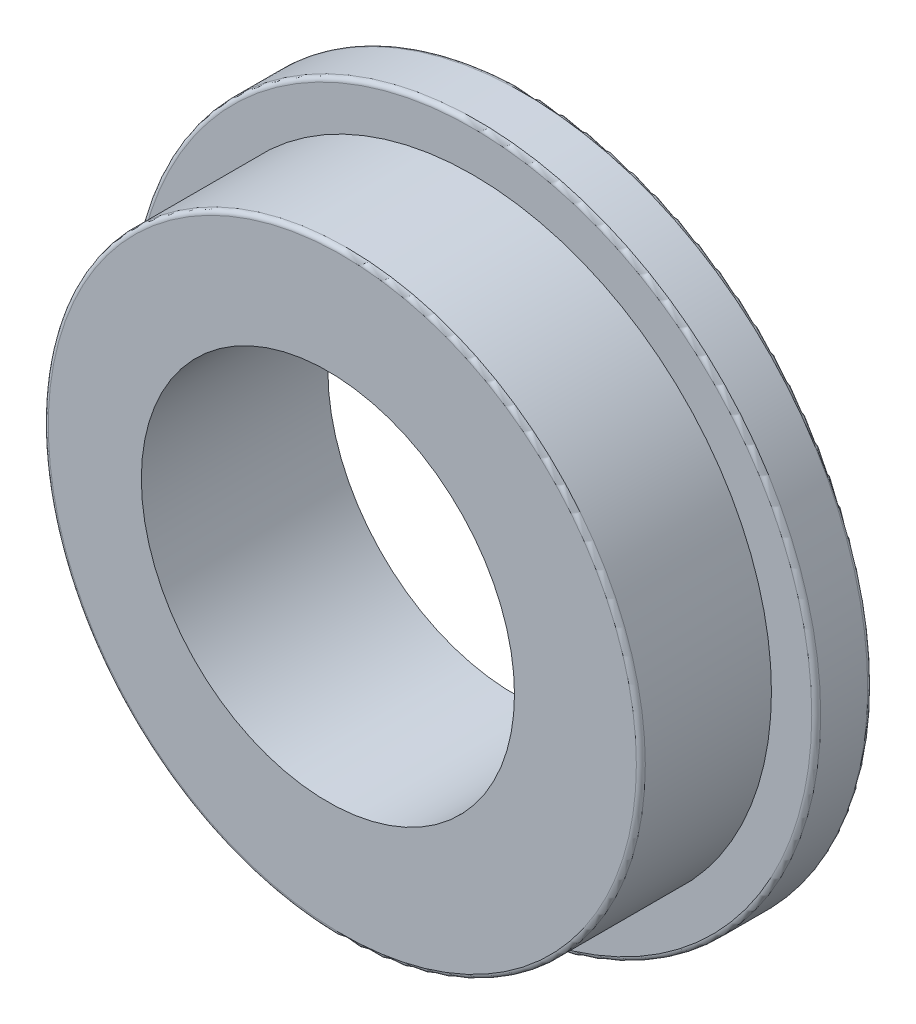
ISO-10303-21;
HEADER;
FILE_DESCRIPTION(('STEP AP214'),'2;1');
FILE_NAME('part.step','',(''),(''),'','','');
FILE_SCHEMA(('AUTOMOTIVE_DESIGN { 1 0 10303 214 1 1 1 1 }'));
ENDSEC;
DATA;
#1=APPLICATION_CONTEXT('core data for automotive mechanical design processes');
#2=APPLICATION_PROTOCOL_DEFINITION('international standard','automotive_design',2000,#1);
#3=PRODUCT_CONTEXT('',#1,'mechanical');
#4=PRODUCT('Part','Part','',(#3));
#5=PRODUCT_RELATED_PRODUCT_CATEGORY('part','',(#4));
#6=PRODUCT_DEFINITION_FORMATION('','',#4);
#7=PRODUCT_DEFINITION_CONTEXT('part definition',#1,'design');
#8=PRODUCT_DEFINITION('design','',#6,#7);
#9=PRODUCT_DEFINITION_SHAPE('','',#8);
#10=(LENGTH_UNIT() NAMED_UNIT(*) SI_UNIT(.MILLI.,.METRE.));
#11=(NAMED_UNIT(*) PLANE_ANGLE_UNIT() SI_UNIT($,.RADIAN.));
#12=(NAMED_UNIT(*) SI_UNIT($,.STERADIAN.) SOLID_ANGLE_UNIT());
#13=UNCERTAINTY_MEASURE_WITH_UNIT(LENGTH_MEASURE(1.E-05),#10,'distance_accuracy_value','');
#14=(GEOMETRIC_REPRESENTATION_CONTEXT(3) GLOBAL_UNCERTAINTY_ASSIGNED_CONTEXT((#13)) GLOBAL_UNIT_ASSIGNED_CONTEXT((#10,
#11,#12)) REPRESENTATION_CONTEXT('',''));
#15=CARTESIAN_POINT('',(0.,0.,0.));
#16=DIRECTION('',(0.,0.,1.));
#17=DIRECTION('',(1.,0.,0.));
#18=AXIS2_PLACEMENT_3D('',#15,#16,#17);
#19=CARTESIAN_POINT('',(0.,0.,0.75));
#20=DIRECTION('',(0.,0.,-1.));
#21=DIRECTION('',(-1.,0.,0.));
#22=AXIS2_PLACEMENT_3D('',#19,#20,#21);
#23=CYLINDRICAL_SURFACE('',#22,4.6);
#24=CARTESIAN_POINT('',(0.,0.,0.0599999999999999));
#25=DIRECTION('',(0.,0.,1.));
#26=DIRECTION('',(1.,0.,0.));
#27=AXIS2_PLACEMENT_3D('',#24,#25,#26);
#28=CIRCLE('',#27,4.6);
#29=CARTESIAN_POINT('',(4.6,0.,0.0599999999999999));
#30=VERTEX_POINT('',#29);
#31=EDGE_CURVE('E61',#30,#30,#28,.T.);
#32=ORIENTED_EDGE('',*,*,#31,.T.);
#33=EDGE_LOOP('',(#32));
#34=FACE_BOUND('',#33,.T.);
#35=CARTESIAN_POINT('',(0.,0.,0.69));
#36=DIRECTION('',(0.,0.,1.));
#37=DIRECTION('',(1.,0.,0.));
#38=AXIS2_PLACEMENT_3D('',#35,#36,#37);
#39=CIRCLE('',#38,4.6);
#40=CARTESIAN_POINT('',(4.6,0.,0.69));
#41=VERTEX_POINT('',#40);
#42=EDGE_CURVE('E65',#41,#41,#39,.F.);
#43=ORIENTED_EDGE('',*,*,#42,.T.);
#44=EDGE_LOOP('',(#43));
#45=FACE_BOUND('',#44,.T.);
#46=ADVANCED_FACE('F37',(#34,#45),#23,.T.);
#47=CARTESIAN_POINT('',(0.,0.,0.75));
#48=DIRECTION('',(0.,0.,1.));
#49=DIRECTION('',(1.,0.,0.));
#50=AXIS2_PLACEMENT_3D('',#47,#48,#49);
#51=PLANE('',#50);
#52=CARTESIAN_POINT('',(0.,0.,0.75));
#53=DIRECTION('',(0.,0.,1.));
#54=DIRECTION('',(1.,0.,0.));
#55=AXIS2_PLACEMENT_3D('',#52,#53,#54);
#56=CIRCLE('',#55,4.54);
#57=CARTESIAN_POINT('',(4.54,0.,0.75));
#58=VERTEX_POINT('',#57);
#59=EDGE_CURVE('E50',#58,#58,#56,.T.);
#60=ORIENTED_EDGE('',*,*,#59,.T.);
#61=EDGE_LOOP('',(#60));
#62=FACE_BOUND('',#61,.T.);
#63=CARTESIAN_POINT('',(0.,0.,0.75));
#64=DIRECTION('',(0.,0.,1.));
#65=DIRECTION('',(1.,0.,0.));
#66=AXIS2_PLACEMENT_3D('',#63,#64,#65);
#67=CIRCLE('',#66,4.);
#68=CARTESIAN_POINT('',(4.,0.,0.75));
#69=VERTEX_POINT('',#68);
#70=EDGE_CURVE('E69',#69,#69,#67,.T.);
#71=ORIENTED_EDGE('',*,*,#70,.F.);
#72=EDGE_LOOP('',(#71));
#73=FACE_BOUND('',#72,.T.);
#74=ADVANCED_FACE('F100',(#62,#73),#51,.T.);
#75=CARTESIAN_POINT('',(0.,0.,0.));
#76=DIRECTION('',(0.,0.,1.));
#77=DIRECTION('',(1.,0.,0.));
#78=AXIS2_PLACEMENT_3D('',#75,#76,#77);
#79=PLANE('',#78);
#80=CARTESIAN_POINT('',(0.,0.,0.));
#81=DIRECTION('',(0.,0.,1.));
#82=DIRECTION('',(1.,0.,0.));
#83=AXIS2_PLACEMENT_3D('',#80,#81,#82);
#84=CIRCLE('',#83,4.54);
#85=CARTESIAN_POINT('',(4.54,0.,0.));
#86=VERTEX_POINT('',#85);
#87=EDGE_CURVE('E55',#86,#86,#84,.F.);
#88=ORIENTED_EDGE('',*,*,#87,.T.);
#89=EDGE_LOOP('',(#88));
#90=FACE_BOUND('',#89,.T.);
#91=CARTESIAN_POINT('',(-0.193142297746363,0.,0.));
#92=DIRECTION('',(0.,0.,1.));
#93=DIRECTION('',(1.,0.,0.));
#94=AXIS2_PLACEMENT_3D('',#91,#92,#93);
#95=CIRCLE('',#94,2.5);
#96=CARTESIAN_POINT('',(2.30685770225364,0.,0.));
#97=VERTEX_POINT('',#96);
#98=EDGE_CURVE('E73',#97,#97,#95,.T.);
#99=ORIENTED_EDGE('',*,*,#98,.T.);
#100=EDGE_LOOP('',(#99));
#101=FACE_BOUND('',#100,.T.);
#102=ADVANCED_FACE('F82',(#90,#101),#79,.F.);
#103=CARTESIAN_POINT('',(0.,0.,2.5));
#104=DIRECTION('',(0.,0.,-1.));
#105=DIRECTION('',(-1.,0.,0.));
#106=AXIS2_PLACEMENT_3D('',#103,#104,#105);
#107=CYLINDRICAL_SURFACE('',#106,4.);
#108=CARTESIAN_POINT('',(0.,0.,2.44));
#109=DIRECTION('',(0.,0.,1.));
#110=DIRECTION('',(1.,0.,0.));
#111=AXIS2_PLACEMENT_3D('',#108,#109,#110);
#112=CIRCLE('',#111,4.);
#113=CARTESIAN_POINT('',(4.,0.,2.44));
#114=VERTEX_POINT('',#113);
#115=EDGE_CURVE('E10',#114,#114,#112,.F.);
#116=ORIENTED_EDGE('',*,*,#115,.T.);
#117=EDGE_LOOP('',(#116));
#118=FACE_BOUND('',#117,.T.);
#119=ORIENTED_EDGE('',*,*,#70,.T.);
#120=EDGE_LOOP('',(#119));
#121=FACE_BOUND('',#120,.T.);
#122=ADVANCED_FACE('F93',(#118,#121),#107,.T.);
#123=CARTESIAN_POINT('',(0.,0.,2.5));
#124=DIRECTION('',(0.,0.,1.));
#125=DIRECTION('',(1.,0.,0.));
#126=AXIS2_PLACEMENT_3D('',#123,#124,#125);
#127=PLANE('',#126);
#128=CARTESIAN_POINT('',(0.,0.,2.5));
#129=DIRECTION('',(0.,0.,1.));
#130=DIRECTION('',(1.,0.,0.));
#131=AXIS2_PLACEMENT_3D('',#128,#129,#130);
#132=CIRCLE('',#131,3.94);
#133=CARTESIAN_POINT('',(3.94,0.,2.5));
#134=VERTEX_POINT('',#133);
#135=EDGE_CURVE('E45',#134,#134,#132,.T.);
#136=ORIENTED_EDGE('',*,*,#135,.T.);
#137=EDGE_LOOP('',(#136));
#138=FACE_BOUND('',#137,.T.);
#139=CARTESIAN_POINT('',(-0.193142297746363,0.,2.5));
#140=DIRECTION('',(0.,0.,1.));
#141=DIRECTION('',(1.,0.,0.));
#142=AXIS2_PLACEMENT_3D('',#139,#140,#141);
#143=CIRCLE('',#142,2.5);
#144=CARTESIAN_POINT('',(2.30685770225364,0.,2.5));
#145=VERTEX_POINT('',#144);
#146=EDGE_CURVE('E74',#145,#145,#143,.T.);
#147=ORIENTED_EDGE('',*,*,#146,.F.);
#148=EDGE_LOOP('',(#147));
#149=FACE_BOUND('',#148,.T.);
#150=ADVANCED_FACE('F88',(#138,#149),#127,.T.);
#151=CARTESIAN_POINT('',(-0.193142297746363,0.,0.));
#152=DIRECTION('',(0.,0.,1.));
#153=DIRECTION('',(1.,0.,0.));
#154=AXIS2_PLACEMENT_3D('',#151,#152,#153);
#155=CYLINDRICAL_SURFACE('',#154,2.5);
#156=ORIENTED_EDGE('',*,*,#98,.F.);
#157=EDGE_LOOP('',(#156));
#158=FACE_BOUND('',#157,.T.);
#159=ORIENTED_EDGE('',*,*,#146,.T.);
#160=EDGE_LOOP('',(#159));
#161=FACE_BOUND('',#160,.T.);
#162=ADVANCED_FACE('F84',(#158,#161),#155,.F.);
#163=CARTESIAN_POINT('',(0.,0.,0.0599999999999999));
#164=DIRECTION('',(0.,0.,1.));
#165=DIRECTION('',(1.,0.,0.));
#166=AXIS2_PLACEMENT_3D('',#163,#164,#165);
#167=TOROIDAL_SURFACE('',#166,4.54,0.06);
#168=ORIENTED_EDGE('',*,*,#87,.F.);
#169=EDGE_LOOP('',(#168));
#170=FACE_BOUND('',#169,.T.);
#171=ORIENTED_EDGE('',*,*,#31,.F.);
#172=EDGE_LOOP('',(#171));
#173=FACE_BOUND('',#172,.T.);
#174=ADVANCED_FACE('F87',(#170,#173),#167,.T.);
#175=CARTESIAN_POINT('',(0.,0.,0.69));
#176=DIRECTION('',(0.,0.,1.));
#177=DIRECTION('',(1.,0.,0.));
#178=AXIS2_PLACEMENT_3D('',#175,#176,#177);
#179=TOROIDAL_SURFACE('',#178,4.54,0.06);
#180=ORIENTED_EDGE('',*,*,#42,.F.);
#181=EDGE_LOOP('',(#180));
#182=FACE_BOUND('',#181,.T.);
#183=ORIENTED_EDGE('',*,*,#59,.F.);
#184=EDGE_LOOP('',(#183));
#185=FACE_BOUND('',#184,.T.);
#186=ADVANCED_FACE('F112',(#182,#185),#179,.T.);
#187=CARTESIAN_POINT('',(0.,0.,2.44));
#188=DIRECTION('',(0.,0.,1.));
#189=DIRECTION('',(1.,0.,0.));
#190=AXIS2_PLACEMENT_3D('',#187,#188,#189);
#191=TOROIDAL_SURFACE('',#190,3.94,0.06);
#192=ORIENTED_EDGE('',*,*,#115,.F.);
#193=EDGE_LOOP('',(#192));
#194=FACE_BOUND('',#193,.T.);
#195=ORIENTED_EDGE('',*,*,#135,.F.);
#196=EDGE_LOOP('',(#195));
#197=FACE_BOUND('',#196,.T.);
#198=ADVANCED_FACE('F39',(#194,#197),#191,.T.);
#199=CLOSED_SHELL('',(#46,#74,#102,#122,#150,#162,#174,#186,#198));
#200=MANIFOLD_SOLID_BREP('B2',#199);
#201=ADVANCED_BREP_SHAPE_REPRESENTATION('',(#18,#200),#14);
#202=SHAPE_DEFINITION_REPRESENTATION(#9,#201);
ENDSEC;
END-ISO-10303-21;
